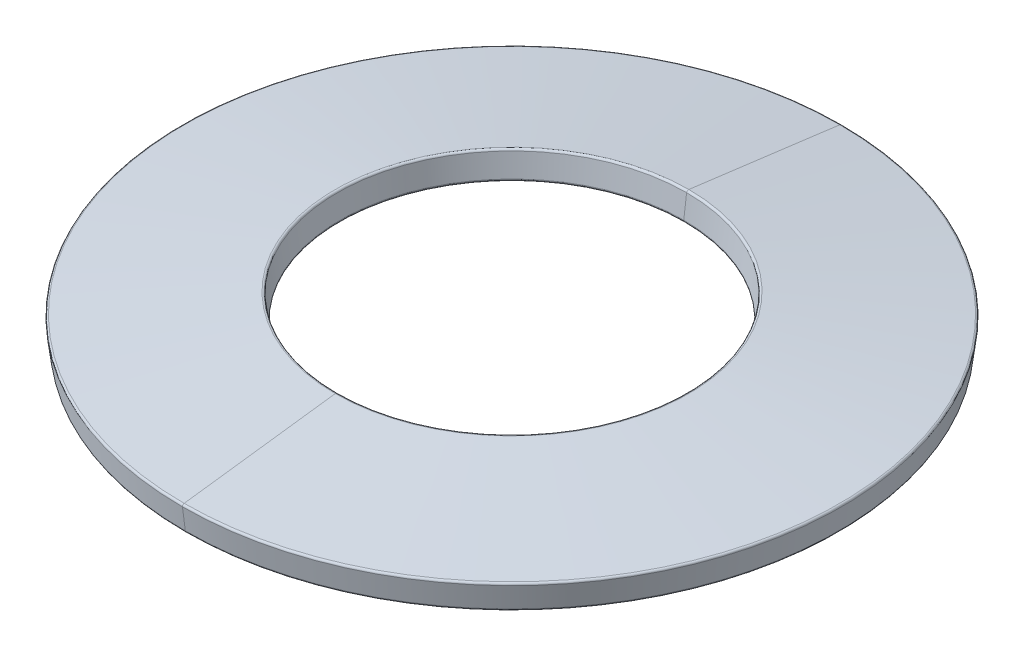
ISO-10303-21;
HEADER;
FILE_DESCRIPTION(('STEP AP214'),'2;1');
FILE_NAME('part.step','',(''),(''),'','','');
FILE_SCHEMA(('AUTOMOTIVE_DESIGN { 1 0 10303 214 1 1 1 1 }'));
ENDSEC;
DATA;
#1=APPLICATION_CONTEXT('core data for automotive mechanical design processes');
#2=APPLICATION_PROTOCOL_DEFINITION('international standard','automotive_design',2000,#1);
#3=PRODUCT_CONTEXT('',#1,'mechanical');
#4=PRODUCT('Part','Part','',(#3));
#5=PRODUCT_RELATED_PRODUCT_CATEGORY('part','',(#4));
#6=PRODUCT_DEFINITION_FORMATION('','',#4);
#7=PRODUCT_DEFINITION_CONTEXT('part definition',#1,'design');
#8=PRODUCT_DEFINITION('design','',#6,#7);
#9=PRODUCT_DEFINITION_SHAPE('','',#8);
#10=(LENGTH_UNIT() NAMED_UNIT(*) SI_UNIT(.MILLI.,.METRE.));
#11=(NAMED_UNIT(*) PLANE_ANGLE_UNIT() SI_UNIT($,.RADIAN.));
#12=(NAMED_UNIT(*) SI_UNIT($,.STERADIAN.) SOLID_ANGLE_UNIT());
#13=UNCERTAINTY_MEASURE_WITH_UNIT(LENGTH_MEASURE(1.E-05),#10,'distance_accuracy_value','');
#14=(GEOMETRIC_REPRESENTATION_CONTEXT(3) GLOBAL_UNCERTAINTY_ASSIGNED_CONTEXT((#13)) GLOBAL_UNIT_ASSIGNED_CONTEXT((#10,
#11,#12)) REPRESENTATION_CONTEXT('',''));
#15=CARTESIAN_POINT('',(0.,0.,0.));
#16=DIRECTION('',(0.,0.,1.));
#17=DIRECTION('',(1.,0.,0.));
#18=AXIS2_PLACEMENT_3D('',#15,#16,#17);
#19=CARTESIAN_POINT('',(0.,0.316405070309197,0.));
#20=DIRECTION('',(0.,-1.,0.));
#21=DIRECTION('',(0.,0.,-1.));
#22=AXIS2_PLACEMENT_3D('',#19,#20,#21);
#23=TOROIDAL_SURFACE('',#22,2.67713711285771,0.03);
#24=CARTESIAN_POINT('',(0.,0.316405070309197,2.67713711285771));
#25=DIRECTION('',(1.,0.,0.));
#26=DIRECTION('',(0.,0.,-1.));
#27=AXIS2_PLACEMENT_3D('',#24,#25,#26);
#28=CIRCLE('',#27,0.03);
#29=CARTESIAN_POINT('',(0.,0.320247027647453,2.64738414050517));
#30=VERTEX_POINT('',#29);
#31=CARTESIAN_POINT('',(0.,0.346158042661737,2.68097907019597));
#32=VERTEX_POINT('',#31);
#33=EDGE_CURVE('E163',#30,#32,#28,.T.);
#34=ORIENTED_EDGE('',*,*,#33,.F.);
#35=CARTESIAN_POINT('',(0.,0.320247027647453,0.));
#36=DIRECTION('',(0.,1.,0.));
#37=DIRECTION('',(0.,0.,-1.));
#38=AXIS2_PLACEMENT_3D('',#35,#36,#37);
#39=CIRCLE('',#38,2.64738414050517);
#40=CARTESIAN_POINT('',(0.,0.320247027647453,-2.64738414050517));
#41=VERTEX_POINT('',#40);
#42=EDGE_CURVE('E193',#41,#30,#39,.T.);
#43=ORIENTED_EDGE('',*,*,#42,.F.);
#44=CARTESIAN_POINT('',(0.,0.316405070309197,-2.67713711285771));
#45=DIRECTION('',(-1.,0.,0.));
#46=DIRECTION('',(0.,0.,1.));
#47=AXIS2_PLACEMENT_3D('',#44,#45,#46);
#48=CIRCLE('',#47,0.03);
#49=CARTESIAN_POINT('',(0.,0.346158042661737,-2.68097907019597));
#50=VERTEX_POINT('',#49);
#51=EDGE_CURVE('E171',#41,#50,#48,.T.);
#52=ORIENTED_EDGE('',*,*,#51,.T.);
#53=CARTESIAN_POINT('',(0.,0.346158042661737,0.));
#54=DIRECTION('',(0.,-1.,0.));
#55=DIRECTION('',(0.,0.,1.));
#56=AXIS2_PLACEMENT_3D('',#53,#54,#55);
#57=CIRCLE('',#56,2.68097907019597);
#58=EDGE_CURVE('E130',#32,#50,#57,.T.);
#59=ORIENTED_EDGE('',*,*,#58,.F.);
#60=EDGE_LOOP('',(#34,#43,#52,#59));
#61=FACE_BOUND('',#60,.T.);
#62=ADVANCED_FACE('F16',(#61),#23,.T.);
#63=CARTESIAN_POINT('',(0.,0.0207952830195797,0.));
#64=DIRECTION('',(0.,-1.,0.));
#65=DIRECTION('',(0.,0.,-1.));
#66=AXIS2_PLACEMENT_3D('',#63,#64,#65);
#67=TOROIDAL_SURFACE('',#66,4.96640507030921,0.03);
#68=CARTESIAN_POINT('',(0.,0.0207952830195797,4.96640507030921));
#69=DIRECTION('',(1.,0.,0.));
#70=DIRECTION('',(0.,0.,-1.));
#71=AXIS2_PLACEMENT_3D('',#68,#69,#70);
#72=CIRCLE('',#71,0.0299999999999996);
#73=CARTESIAN_POINT('',(0.,0.0505482553721196,4.97024702764747));
#74=VERTEX_POINT('',#73);
#75=CARTESIAN_POINT('',(0.,0.0169533256813292,4.99615804266175));
#76=VERTEX_POINT('',#75);
#77=EDGE_CURVE('E181',#74,#76,#72,.T.);
#78=ORIENTED_EDGE('',*,*,#77,.F.);
#79=CARTESIAN_POINT('',(0.,0.0505482553721196,0.));
#80=DIRECTION('',(0.,1.,0.));
#81=DIRECTION('',(0.,0.,1.));
#82=AXIS2_PLACEMENT_3D('',#79,#80,#81);
#83=CIRCLE('',#82,4.97024702764747);
#84=CARTESIAN_POINT('',(0.,0.0505482553721196,-4.97024702764747));
#85=VERTEX_POINT('',#84);
#86=EDGE_CURVE('E189',#85,#74,#83,.T.);
#87=ORIENTED_EDGE('',*,*,#86,.F.);
#88=CARTESIAN_POINT('',(0.,0.0207952830195797,-4.96640507030921));
#89=DIRECTION('',(-1.,0.,0.));
#90=DIRECTION('',(0.,0.,1.));
#91=AXIS2_PLACEMENT_3D('',#88,#89,#90);
#92=CIRCLE('',#91,0.0299999999999996);
#93=CARTESIAN_POINT('',(0.,0.0169533256813292,-4.99615804266175));
#94=VERTEX_POINT('',#93);
#95=EDGE_CURVE('E180',#85,#94,#92,.T.);
#96=ORIENTED_EDGE('',*,*,#95,.T.);
#97=CARTESIAN_POINT('',(0.,0.0169533256813292,0.));
#98=DIRECTION('',(0.,-1.,0.));
#99=DIRECTION('',(0.,0.,-1.));
#100=AXIS2_PLACEMENT_3D('',#97,#98,#99);
#101=CIRCLE('',#100,4.99615804266175);
#102=EDGE_CURVE('E11',#76,#94,#101,.T.);
#103=ORIENTED_EDGE('',*,*,#102,.F.);
#104=EDGE_LOOP('',(#78,#87,#96,#103));
#105=FACE_BOUND('',#104,.T.);
#106=ADVANCED_FACE('F296',(#105),#67,.T.);
#107=CARTESIAN_POINT('',(0.,-0.316405070309208,0.));
#108=DIRECTION('',(0.,-1.,0.));
#109=DIRECTION('',(0.,0.,-1.));
#110=AXIS2_PLACEMENT_3D('',#107,#108,#109);
#111=TOROIDAL_SURFACE('',#110,4.92286288714228,0.03);
#112=CARTESIAN_POINT('',(0.,-0.316405070309208,4.92286288714228));
#113=DIRECTION('',(1.,0.,0.));
#114=DIRECTION('',(0.,0.,-1.));
#115=AXIS2_PLACEMENT_3D('',#112,#113,#114);
#116=CIRCLE('',#115,0.0299999999999996);
#117=CARTESIAN_POINT('',(0.,-0.320247027647463,4.95261585949482));
#118=VERTEX_POINT('',#117);
#119=CARTESIAN_POINT('',(0.,-0.346158042661747,4.91902092980402));
#120=VERTEX_POINT('',#119);
#121=EDGE_CURVE('E149',#118,#120,#116,.T.);
#122=ORIENTED_EDGE('',*,*,#121,.F.);
#123=CARTESIAN_POINT('',(0.,-0.320247027647463,0.));
#124=DIRECTION('',(0.,1.,0.));
#125=DIRECTION('',(0.,0.,-1.));
#126=AXIS2_PLACEMENT_3D('',#123,#124,#125);
#127=CIRCLE('',#126,4.95261585949482);
#128=CARTESIAN_POINT('',(0.,-0.320247027647463,-4.95261585949482));
#129=VERTEX_POINT('',#128);
#130=EDGE_CURVE('E27',#129,#118,#127,.T.);
#131=ORIENTED_EDGE('',*,*,#130,.F.);
#132=CARTESIAN_POINT('',(0.,-0.316405070309208,-4.92286288714228));
#133=DIRECTION('',(-1.,0.,0.));
#134=DIRECTION('',(0.,0.,1.));
#135=AXIS2_PLACEMENT_3D('',#132,#133,#134);
#136=CIRCLE('',#135,0.0299999999999996);
#137=CARTESIAN_POINT('',(0.,-0.346158042661747,-4.91902092980402));
#138=VERTEX_POINT('',#137);
#139=EDGE_CURVE('E140',#129,#138,#136,.T.);
#140=ORIENTED_EDGE('',*,*,#139,.T.);
#141=CARTESIAN_POINT('',(0.,-0.346158042661747,0.));
#142=DIRECTION('',(0.,-1.,0.));
#143=DIRECTION('',(0.,0.,1.));
#144=AXIS2_PLACEMENT_3D('',#141,#142,#143);
#145=CIRCLE('',#144,4.91902092980402);
#146=EDGE_CURVE('E131',#120,#138,#145,.T.);
#147=ORIENTED_EDGE('',*,*,#146,.F.);
#148=EDGE_LOOP('',(#122,#131,#140,#147));
#149=FACE_BOUND('',#148,.T.);
#150=ADVANCED_FACE('F18',(#149),#111,.T.);
#151=CARTESIAN_POINT('',(0.,-0.0207952830195891,0.));
#152=DIRECTION('',(0.,-1.,0.));
#153=DIRECTION('',(0.,0.,-1.));
#154=AXIS2_PLACEMENT_3D('',#151,#152,#153);
#155=TOROIDAL_SURFACE('',#154,2.6335949296908,0.03);
#156=CARTESIAN_POINT('',(0.,-0.0207952830195891,0.));
#157=DIRECTION('',(0.,-1.,0.));
#158=DIRECTION('',(0.,0.,-1.));
#159=AXIS2_PLACEMENT_3D('',#156,#157,#158);
#160=CIRCLE('',#159,2.6035949296908);
#161=CARTESIAN_POINT('',(0.,-0.0207952830195891,2.6035949296908));
#162=VERTEX_POINT('',#161);
#163=CARTESIAN_POINT('',(0.,-0.0207952830195891,-2.6035949296908));
#164=VERTEX_POINT('',#163);
#165=EDGE_CURVE('E206',#162,#164,#160,.T.);
#166=ORIENTED_EDGE('',*,*,#165,.F.);
#167=CARTESIAN_POINT('',(0.,-0.0207952830195891,2.6335949296908));
#168=DIRECTION('',(1.,0.,0.));
#169=DIRECTION('',(0.,0.,-1.));
#170=AXIS2_PLACEMENT_3D('',#167,#168,#169);
#171=CIRCLE('',#170,0.03);
#172=CARTESIAN_POINT('',(0.,-0.0505482553721291,2.62975297235254));
#173=VERTEX_POINT('',#172);
#174=EDGE_CURVE('E91',#173,#162,#171,.T.);
#175=ORIENTED_EDGE('',*,*,#174,.F.);
#176=CARTESIAN_POINT('',(0.,-0.0505482553721291,0.));
#177=DIRECTION('',(0.,1.,0.));
#178=DIRECTION('',(0.,0.,1.));
#179=AXIS2_PLACEMENT_3D('',#176,#177,#178);
#180=CIRCLE('',#179,2.62975297235254);
#181=CARTESIAN_POINT('',(0.,-0.0505482553721291,-2.62975297235254));
#182=VERTEX_POINT('',#181);
#183=EDGE_CURVE('E199',#182,#173,#180,.T.);
#184=ORIENTED_EDGE('',*,*,#183,.F.);
#185=CARTESIAN_POINT('',(0.,-0.0207952830195891,-2.6335949296908));
#186=DIRECTION('',(-1.,0.,0.));
#187=DIRECTION('',(0.,0.,1.));
#188=AXIS2_PLACEMENT_3D('',#185,#186,#187);
#189=CIRCLE('',#188,0.03);
#190=EDGE_CURVE('E146',#182,#164,#189,.T.);
#191=ORIENTED_EDGE('',*,*,#190,.T.);
#192=EDGE_LOOP('',(#166,#175,#184,#191));
#193=FACE_BOUND('',#192,.T.);
#194=ADVANCED_FACE('F276',(#193),#155,.T.);
#195=CARTESIAN_POINT('',(0.,-0.350000000000005,0.));
#196=DIRECTION('',(0.,1.,0.));
#197=DIRECTION('',(0.,0.,1.));
#198=AXIS2_PLACEMENT_3D('',#195,#196,#197);
#199=CONICAL_SURFACE('',#198,4.94877390215656,0.128417913759532);
#200=DIRECTION('',(0.,0.991765745084663,-0.128065244608607));
#201=VECTOR('',#200,1.);
#202=CARTESIAN_POINT('',(0.,-0.350000000000005,-4.94877390215656));
#203=LINE('',#202,#201);
#204=EDGE_CURVE('E202',#129,#94,#203,.T.);
#205=ORIENTED_EDGE('',*,*,#204,.F.);
#206=ORIENTED_EDGE('',*,*,#130,.T.);
#207=DIRECTION('',(0.,0.991765745084663,0.128065244608607));
#208=VECTOR('',#207,1.);
#209=CARTESIAN_POINT('',(0.,-0.350000000000005,4.94877390215656));
#210=LINE('',#209,#208);
#211=EDGE_CURVE('E185',#118,#76,#210,.T.);
#212=ORIENTED_EDGE('',*,*,#211,.T.);
#213=ORIENTED_EDGE('',*,*,#102,.T.);
#214=EDGE_LOOP('',(#205,#206,#212,#213));
#215=FACE_BOUND('',#214,.T.);
#216=ADVANCED_FACE('F321',(#215),#199,.T.);
#217=CARTESIAN_POINT('',(0.,0.0467062980338622,0.));
#218=DIRECTION('',(0.,-1.,0.));
#219=DIRECTION('',(0.,0.,-1.));
#220=AXIS2_PLACEMENT_3D('',#217,#218,#219);
#221=CONICAL_SURFACE('',#220,5.,1.44237841303539);
#222=DIRECTION('',(0.,-0.128065244608579,0.991765745084667));
#223=VECTOR('',#222,1.);
#224=CARTESIAN_POINT('',(0.,0.0467062980338622,5.));
#225=LINE('',#224,#223);
#226=EDGE_CURVE('E182',#32,#74,#225,.T.);
#227=ORIENTED_EDGE('',*,*,#226,.F.);
#228=ORIENTED_EDGE('',*,*,#58,.T.);
#229=DIRECTION('',(0.,-0.128065244608579,-0.991765745084667));
#230=VECTOR('',#229,1.);
#231=CARTESIAN_POINT('',(0.,0.0467062980338622,-5.));
#232=LINE('',#231,#230);
#233=EDGE_CURVE('E161',#50,#85,#232,.T.);
#234=ORIENTED_EDGE('',*,*,#233,.T.);
#235=ORIENTED_EDGE('',*,*,#86,.T.);
#236=EDGE_LOOP('',(#227,#228,#234,#235));
#237=FACE_BOUND('',#236,.T.);
#238=ADVANCED_FACE('F254',(#237),#221,.T.);
#239=CARTESIAN_POINT('',(0.,0.349999999999995,0.));
#240=DIRECTION('',(0.,1.,0.));
#241=DIRECTION('',(0.,0.,1.));
#242=AXIS2_PLACEMENT_3D('',#239,#240,#241);
#243=CONICAL_SURFACE('',#242,2.65122609784343,0.128417913759498);
#244=DIRECTION('',(0.,0.991765745084668,-0.128065244608573));
#245=VECTOR('',#244,1.);
#246=CARTESIAN_POINT('',(0.,0.349999999999995,-2.65122609784343));
#247=LINE('',#246,#245);
#248=CARTESIAN_POINT('',(0.,-0.0169533256813292,-2.60384195733825));
#249=VERTEX_POINT('',#248);
#250=EDGE_CURVE('E195',#249,#41,#247,.T.);
#251=ORIENTED_EDGE('',*,*,#250,.F.);
#252=CARTESIAN_POINT('',(0.,-0.0169533256813292,0.));
#253=DIRECTION('',(0.,-1.,0.));
#254=DIRECTION('',(0.,0.,-1.));
#255=AXIS2_PLACEMENT_3D('',#252,#253,#254);
#256=CIRCLE('',#255,2.60384195733825);
#257=CARTESIAN_POINT('',(0.,-0.0169533256813292,2.60384195733825));
#258=VERTEX_POINT('',#257);
#259=EDGE_CURVE('E233',#249,#258,#256,.T.);
#260=ORIENTED_EDGE('',*,*,#259,.T.);
#261=DIRECTION('',(0.,0.991765745084668,0.128065244608573));
#262=VECTOR('',#261,1.);
#263=CARTESIAN_POINT('',(0.,0.349999999999995,2.65122609784343));
#264=LINE('',#263,#262);
#265=EDGE_CURVE('E102',#258,#30,#264,.T.);
#266=ORIENTED_EDGE('',*,*,#265,.T.);
#267=CARTESIAN_POINT('',(0.,0.320247027647453,0.));
#268=DIRECTION('',(0.,1.,0.));
#269=DIRECTION('',(0.,0.,-1.));
#270=AXIS2_PLACEMENT_3D('',#267,#268,#269);
#271=CIRCLE('',#270,2.64738414050517);
#272=EDGE_CURVE('E167',#30,#41,#271,.T.);
#273=ORIENTED_EDGE('',*,*,#272,.T.);
#274=EDGE_LOOP('',(#251,#260,#266,#273));
#275=FACE_BOUND('',#274,.T.);
#276=ADVANCED_FACE('F305',(#275),#243,.F.);
#277=CARTESIAN_POINT('',(0.,-0.0467062980338717,0.));
#278=DIRECTION('',(0.,-1.,0.));
#279=DIRECTION('',(0.,0.,-1.));
#280=AXIS2_PLACEMENT_3D('',#277,#278,#279);
#281=CONICAL_SURFACE('',#280,2.6,1.44237841303539);
#282=DIRECTION('',(0.,-0.12806524460858,0.991765745084667));
#283=VECTOR('',#282,1.);
#284=CARTESIAN_POINT('',(0.,-0.0467062980338717,2.6));
#285=LINE('',#284,#283);
#286=EDGE_CURVE('E42',#173,#120,#285,.T.);
#287=ORIENTED_EDGE('',*,*,#286,.F.);
#288=CARTESIAN_POINT('',(0.,-0.0505482553721291,0.));
#289=DIRECTION('',(0.,1.,0.));
#290=DIRECTION('',(0.,0.,1.));
#291=AXIS2_PLACEMENT_3D('',#288,#289,#290);
#292=CIRCLE('',#291,2.62975297235254);
#293=EDGE_CURVE('E125',#173,#182,#292,.T.);
#294=ORIENTED_EDGE('',*,*,#293,.T.);
#295=DIRECTION('',(0.,-0.12806524460858,-0.991765745084667));
#296=VECTOR('',#295,1.);
#297=CARTESIAN_POINT('',(0.,-0.0467062980338717,-2.6));
#298=LINE('',#297,#296);
#299=EDGE_CURVE('E119',#182,#138,#298,.T.);
#300=ORIENTED_EDGE('',*,*,#299,.T.);
#301=CARTESIAN_POINT('',(0.,-0.346158042661747,0.));
#302=DIRECTION('',(0.,-1.,0.));
#303=DIRECTION('',(0.,0.,1.));
#304=AXIS2_PLACEMENT_3D('',#301,#302,#303);
#305=CIRCLE('',#304,4.91902092980402);
#306=EDGE_CURVE('E123',#138,#120,#305,.T.);
#307=ORIENTED_EDGE('',*,*,#306,.T.);
#308=EDGE_LOOP('',(#287,#294,#300,#307));
#309=FACE_BOUND('',#308,.T.);
#310=ADVANCED_FACE('F121',(#309),#281,.F.);
#311=CARTESIAN_POINT('',(0.,-0.0467062980338717,0.));
#312=DIRECTION('',(0.,-1.,0.));
#313=DIRECTION('',(0.,0.,-1.));
#314=AXIS2_PLACEMENT_3D('',#311,#312,#313);
#315=CONICAL_SURFACE('',#314,2.6,1.44237841303539);
#316=ORIENTED_EDGE('',*,*,#183,.T.);
#317=ORIENTED_EDGE('',*,*,#286,.T.);
#318=ORIENTED_EDGE('',*,*,#146,.T.);
#319=ORIENTED_EDGE('',*,*,#299,.F.);
#320=EDGE_LOOP('',(#316,#317,#318,#319));
#321=FACE_BOUND('',#320,.T.);
#322=ADVANCED_FACE('F134',(#321),#315,.F.);
#323=CARTESIAN_POINT('',(0.,0.349999999999995,0.));
#324=DIRECTION('',(0.,1.,0.));
#325=DIRECTION('',(0.,0.,1.));
#326=AXIS2_PLACEMENT_3D('',#323,#324,#325);
#327=CONICAL_SURFACE('',#326,2.65122609784343,0.128417913759498);
#328=CARTESIAN_POINT('',(0.,-0.0169533256813292,0.));
#329=DIRECTION('',(0.,-1.,0.));
#330=DIRECTION('',(0.,0.,-1.));
#331=AXIS2_PLACEMENT_3D('',#328,#329,#330);
#332=CIRCLE('',#331,2.60384195733825);
#333=EDGE_CURVE('E224',#258,#249,#332,.T.);
#334=ORIENTED_EDGE('',*,*,#333,.T.);
#335=ORIENTED_EDGE('',*,*,#250,.T.);
#336=ORIENTED_EDGE('',*,*,#42,.T.);
#337=ORIENTED_EDGE('',*,*,#265,.F.);
#338=EDGE_LOOP('',(#334,#335,#336,#337));
#339=FACE_BOUND('',#338,.T.);
#340=ADVANCED_FACE('F282',(#339),#327,.F.);
#341=CARTESIAN_POINT('',(0.,0.0467062980338622,0.));
#342=DIRECTION('',(0.,-1.,0.));
#343=DIRECTION('',(0.,0.,-1.));
#344=AXIS2_PLACEMENT_3D('',#341,#342,#343);
#345=CONICAL_SURFACE('',#344,5.,1.44237841303539);
#346=CARTESIAN_POINT('',(0.,0.346158042661737,0.));
#347=DIRECTION('',(0.,-1.,0.));
#348=DIRECTION('',(0.,0.,1.));
#349=AXIS2_PLACEMENT_3D('',#346,#347,#348);
#350=CIRCLE('',#349,2.68097907019597);
#351=EDGE_CURVE('E166',#50,#32,#350,.T.);
#352=ORIENTED_EDGE('',*,*,#351,.T.);
#353=ORIENTED_EDGE('',*,*,#226,.T.);
#354=CARTESIAN_POINT('',(0.,0.0505482553721196,0.));
#355=DIRECTION('',(0.,1.,0.));
#356=DIRECTION('',(0.,0.,1.));
#357=AXIS2_PLACEMENT_3D('',#354,#355,#356);
#358=CIRCLE('',#357,4.97024702764747);
#359=EDGE_CURVE('E175',#74,#85,#358,.T.);
#360=ORIENTED_EDGE('',*,*,#359,.T.);
#361=ORIENTED_EDGE('',*,*,#233,.F.);
#362=EDGE_LOOP('',(#352,#353,#360,#361));
#363=FACE_BOUND('',#362,.T.);
#364=ADVANCED_FACE('F262',(#363),#345,.T.);
#365=CARTESIAN_POINT('',(0.,-0.350000000000005,0.));
#366=DIRECTION('',(0.,1.,0.));
#367=DIRECTION('',(0.,0.,1.));
#368=AXIS2_PLACEMENT_3D('',#365,#366,#367);
#369=CONICAL_SURFACE('',#368,4.94877390215656,0.128417913759532);
#370=CARTESIAN_POINT('',(0.,-0.320247027647463,0.));
#371=DIRECTION('',(0.,1.,0.));
#372=DIRECTION('',(0.,0.,-1.));
#373=AXIS2_PLACEMENT_3D('',#370,#371,#372);
#374=CIRCLE('',#373,4.95261585949482);
#375=EDGE_CURVE('E157',#118,#129,#374,.T.);
#376=ORIENTED_EDGE('',*,*,#375,.T.);
#377=ORIENTED_EDGE('',*,*,#204,.T.);
#378=CARTESIAN_POINT('',(0.,0.0169533256813292,0.));
#379=DIRECTION('',(0.,-1.,0.));
#380=DIRECTION('',(0.,0.,-1.));
#381=AXIS2_PLACEMENT_3D('',#378,#379,#380);
#382=CIRCLE('',#381,4.99615804266175);
#383=EDGE_CURVE('E176',#94,#76,#382,.T.);
#384=ORIENTED_EDGE('',*,*,#383,.T.);
#385=ORIENTED_EDGE('',*,*,#211,.F.);
#386=EDGE_LOOP('',(#376,#377,#384,#385));
#387=FACE_BOUND('',#386,.T.);
#388=ADVANCED_FACE('F290',(#387),#369,.T.);
#389=CARTESIAN_POINT('',(0.,-0.0207952830195891,0.));
#390=DIRECTION('',(0.,-1.,0.));
#391=DIRECTION('',(0.,0.,-1.));
#392=AXIS2_PLACEMENT_3D('',#389,#390,#391);
#393=TOROIDAL_SURFACE('',#392,2.6335949296908,0.03);
#394=CARTESIAN_POINT('',(0.,-0.0207952830195891,0.));
#395=DIRECTION('',(0.,-1.,0.));
#396=DIRECTION('',(0.,0.,-1.));
#397=AXIS2_PLACEMENT_3D('',#394,#395,#396);
#398=CIRCLE('',#397,2.6035949296908);
#399=EDGE_CURVE('E20',#164,#162,#398,.T.);
#400=ORIENTED_EDGE('',*,*,#399,.F.);
#401=ORIENTED_EDGE('',*,*,#190,.F.);
#402=ORIENTED_EDGE('',*,*,#293,.F.);
#403=ORIENTED_EDGE('',*,*,#174,.T.);
#404=EDGE_LOOP('',(#400,#401,#402,#403));
#405=FACE_BOUND('',#404,.T.);
#406=ADVANCED_FACE('F278',(#405),#393,.T.);
#407=CARTESIAN_POINT('',(0.,-0.316405070309208,0.));
#408=DIRECTION('',(0.,-1.,0.));
#409=DIRECTION('',(0.,0.,-1.));
#410=AXIS2_PLACEMENT_3D('',#407,#408,#409);
#411=TOROIDAL_SURFACE('',#410,4.92286288714228,0.03);
#412=ORIENTED_EDGE('',*,*,#375,.F.);
#413=ORIENTED_EDGE('',*,*,#121,.T.);
#414=ORIENTED_EDGE('',*,*,#306,.F.);
#415=ORIENTED_EDGE('',*,*,#139,.F.);
#416=EDGE_LOOP('',(#412,#413,#414,#415));
#417=FACE_BOUND('',#416,.T.);
#418=ADVANCED_FACE('F148',(#417),#411,.T.);
#419=CARTESIAN_POINT('',(0.,0.0207952830195797,0.));
#420=DIRECTION('',(0.,-1.,0.));
#421=DIRECTION('',(0.,0.,-1.));
#422=AXIS2_PLACEMENT_3D('',#419,#420,#421);
#423=TOROIDAL_SURFACE('',#422,4.96640507030921,0.03);
#424=ORIENTED_EDGE('',*,*,#359,.F.);
#425=ORIENTED_EDGE('',*,*,#77,.T.);
#426=ORIENTED_EDGE('',*,*,#383,.F.);
#427=ORIENTED_EDGE('',*,*,#95,.F.);
#428=EDGE_LOOP('',(#424,#425,#426,#427));
#429=FACE_BOUND('',#428,.T.);
#430=ADVANCED_FACE('F260',(#429),#423,.T.);
#431=CARTESIAN_POINT('',(0.,0.316405070309197,0.));
#432=DIRECTION('',(0.,-1.,0.));
#433=DIRECTION('',(0.,0.,-1.));
#434=AXIS2_PLACEMENT_3D('',#431,#432,#433);
#435=TOROIDAL_SURFACE('',#434,2.67713711285771,0.03);
#436=ORIENTED_EDGE('',*,*,#272,.F.);
#437=ORIENTED_EDGE('',*,*,#33,.T.);
#438=ORIENTED_EDGE('',*,*,#351,.F.);
#439=ORIENTED_EDGE('',*,*,#51,.F.);
#440=EDGE_LOOP('',(#436,#437,#438,#439));
#441=FACE_BOUND('',#440,.T.);
#442=ADVANCED_FACE('F319',(#441),#435,.T.);
#443=CARTESIAN_POINT('',(0.,-0.0207952830195891,0.));
#444=DIRECTION('',(0.,-1.,0.));
#445=DIRECTION('',(0.,0.,-1.));
#446=AXIS2_PLACEMENT_3D('',#443,#444,#445);
#447=TOROIDAL_SURFACE('',#446,2.6335949296908,0.03);
#448=CARTESIAN_POINT('',(0.,-0.0207952830195891,-2.6335949296908));
#449=DIRECTION('',(-1.,0.,0.));
#450=DIRECTION('',(0.,0.,1.));
#451=AXIS2_PLACEMENT_3D('',#448,#449,#450);
#452=CIRCLE('',#451,0.03);
#453=EDGE_CURVE('E215',#164,#249,#452,.T.);
#454=ORIENTED_EDGE('',*,*,#453,.F.);
#455=ORIENTED_EDGE('',*,*,#399,.T.);
#456=CARTESIAN_POINT('',(0.,-0.0207952830195891,2.6335949296908));
#457=DIRECTION('',(1.,0.,0.));
#458=DIRECTION('',(0.,0.,-1.));
#459=AXIS2_PLACEMENT_3D('',#456,#457,#458);
#460=CIRCLE('',#459,0.03);
#461=EDGE_CURVE('E203',#162,#258,#460,.T.);
#462=ORIENTED_EDGE('',*,*,#461,.T.);
#463=ORIENTED_EDGE('',*,*,#259,.F.);
#464=EDGE_LOOP('',(#454,#455,#462,#463));
#465=FACE_BOUND('',#464,.T.);
#466=ADVANCED_FACE('F279',(#465),#447,.T.);
#467=CARTESIAN_POINT('',(0.,-0.0207952830195891,0.));
#468=DIRECTION('',(0.,-1.,0.));
#469=DIRECTION('',(0.,0.,-1.));
#470=AXIS2_PLACEMENT_3D('',#467,#468,#469);
#471=TOROIDAL_SURFACE('',#470,2.6335949296908,0.03);
#472=ORIENTED_EDGE('',*,*,#461,.F.);
#473=ORIENTED_EDGE('',*,*,#165,.T.);
#474=ORIENTED_EDGE('',*,*,#453,.T.);
#475=ORIENTED_EDGE('',*,*,#333,.F.);
#476=EDGE_LOOP('',(#472,#473,#474,#475));
#477=FACE_BOUND('',#476,.T.);
#478=ADVANCED_FACE('F281',(#477),#471,.T.);
#479=CLOSED_SHELL('',(#62,#106,#150,#194,#216,#238,#276,#310,#322,#340,#364,#388,#406,#418,#430,
#442,#466,#478));
#480=MANIFOLD_SOLID_BREP('B1',#479);
#481=ADVANCED_BREP_SHAPE_REPRESENTATION('',(#18,#480),#14);
#482=SHAPE_DEFINITION_REPRESENTATION(#9,#481);
ENDSEC;
END-ISO-10303-21;
